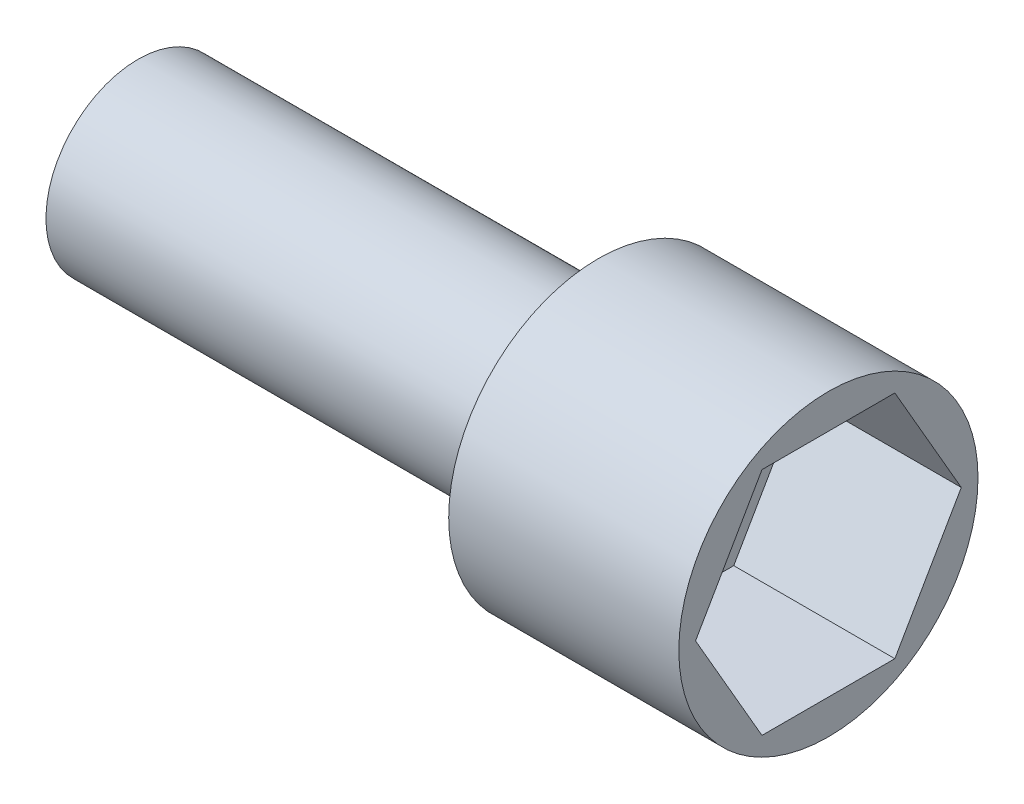
ISO-10303-21;
HEADER;
FILE_DESCRIPTION(('STEP AP214'),'2;1');
FILE_NAME('part.step','',(''),(''),'','','');
FILE_SCHEMA(('AUTOMOTIVE_DESIGN { 1 0 10303 214 1 1 1 1 }'));
ENDSEC;
DATA;
#1=APPLICATION_CONTEXT('core data for automotive mechanical design processes');
#2=APPLICATION_PROTOCOL_DEFINITION('international standard','automotive_design',2000,#1);
#3=PRODUCT_CONTEXT('',#1,'mechanical');
#4=PRODUCT('Part','Part','',(#3));
#5=PRODUCT_RELATED_PRODUCT_CATEGORY('part','',(#4));
#6=PRODUCT_DEFINITION_FORMATION('','',#4);
#7=PRODUCT_DEFINITION_CONTEXT('part definition',#1,'design');
#8=PRODUCT_DEFINITION('design','',#6,#7);
#9=PRODUCT_DEFINITION_SHAPE('','',#8);
#10=(LENGTH_UNIT() NAMED_UNIT(*) SI_UNIT(.MILLI.,.METRE.));
#11=(NAMED_UNIT(*) PLANE_ANGLE_UNIT() SI_UNIT($,.RADIAN.));
#12=(NAMED_UNIT(*) SI_UNIT($,.STERADIAN.) SOLID_ANGLE_UNIT());
#13=UNCERTAINTY_MEASURE_WITH_UNIT(LENGTH_MEASURE(1.E-05),#10,'distance_accuracy_value','');
#14=(GEOMETRIC_REPRESENTATION_CONTEXT(3) GLOBAL_UNCERTAINTY_ASSIGNED_CONTEXT((#13)) GLOBAL_UNIT_ASSIGNED_CONTEXT((#10,
#11,#12)) REPRESENTATION_CONTEXT('',''));
#15=CARTESIAN_POINT('',(0.,0.,0.));
#16=DIRECTION('',(0.,0.,1.));
#17=DIRECTION('',(1.,0.,0.));
#18=AXIS2_PLACEMENT_3D('',#15,#16,#17);
#19=CARTESIAN_POINT('',(15.,6.5,0.));
#20=DIRECTION('',(1.,0.,0.));
#21=DIRECTION('',(0.,1.,0.));
#22=AXIS2_PLACEMENT_3D('',#19,#20,#21);
#23=PLANE('',#22);
#24=DIRECTION('',(0.,0.866025403784439,-0.5));
#25=VECTOR('',#24,1.);
#26=CARTESIAN_POINT('',(15.,-5.,-2.88675134594813));
#27=LINE('',#26,#25);
#28=CARTESIAN_POINT('',(15.,-5.,-2.88675134594813));
#29=VERTEX_POINT('',#28);
#30=CARTESIAN_POINT('',(15.,0.,-5.77350269189626));
#31=VERTEX_POINT('',#30);
#32=EDGE_CURVE('E58',#29,#31,#27,.T.);
#33=ORIENTED_EDGE('',*,*,#32,.F.);
#34=DIRECTION('',(0.,0.,-1.));
#35=VECTOR('',#34,1.);
#36=CARTESIAN_POINT('',(15.,-5.,2.88675134594813));
#37=LINE('',#36,#35);
#38=CARTESIAN_POINT('',(15.,-5.,2.88675134594813));
#39=VERTEX_POINT('',#38);
#40=EDGE_CURVE('E151',#39,#29,#37,.T.);
#41=ORIENTED_EDGE('',*,*,#40,.F.);
#42=DIRECTION('',(0.,-0.866025403784439,-0.5));
#43=VECTOR('',#42,1.);
#44=CARTESIAN_POINT('',(15.,0.,5.77350269189626));
#45=LINE('',#44,#43);
#46=CARTESIAN_POINT('',(15.,0.,5.77350269189626));
#47=VERTEX_POINT('',#46);
#48=EDGE_CURVE('E148',#47,#39,#45,.T.);
#49=ORIENTED_EDGE('',*,*,#48,.F.);
#50=DIRECTION('',(0.,-0.866025403784439,0.5));
#51=VECTOR('',#50,1.);
#52=CARTESIAN_POINT('',(15.,5.,2.88675134594813));
#53=LINE('',#52,#51);
#54=CARTESIAN_POINT('',(15.,5.,2.88675134594813));
#55=VERTEX_POINT('',#54);
#56=EDGE_CURVE('E106',#55,#47,#53,.T.);
#57=ORIENTED_EDGE('',*,*,#56,.F.);
#58=DIRECTION('',(0.,0.,1.));
#59=VECTOR('',#58,1.);
#60=CARTESIAN_POINT('',(15.,5.,-2.88675134594813));
#61=LINE('',#60,#59);
#62=CARTESIAN_POINT('',(15.,5.,-2.88675134594813));
#63=VERTEX_POINT('',#62);
#64=EDGE_CURVE('E142',#63,#55,#61,.T.);
#65=ORIENTED_EDGE('',*,*,#64,.F.);
#66=DIRECTION('',(0.,0.866025403784438,0.5));
#67=VECTOR('',#66,1.);
#68=CARTESIAN_POINT('',(15.,0.,-5.77350269189626));
#69=LINE('',#68,#67);
#70=EDGE_CURVE('E138',#31,#63,#69,.T.);
#71=ORIENTED_EDGE('',*,*,#70,.F.);
#72=EDGE_LOOP('',(#33,#41,#49,#57,#65,#71));
#73=FACE_BOUND('',#72,.T.);
#74=CARTESIAN_POINT('',(15.,0.,0.));
#75=DIRECTION('',(1.,0.,0.));
#76=DIRECTION('',(0.,1.,0.));
#77=AXIS2_PLACEMENT_3D('',#74,#75,#76);
#78=CIRCLE('',#77,6.5);
#79=CARTESIAN_POINT('',(15.,6.5,0.));
#80=VERTEX_POINT('',#79);
#81=EDGE_CURVE('E157',#80,#80,#78,.T.);
#82=ORIENTED_EDGE('',*,*,#81,.T.);
#83=EDGE_LOOP('',(#82));
#84=FACE_BOUND('',#83,.T.);
#85=ADVANCED_FACE('F43',(#73,#84),#23,.T.);
#86=CARTESIAN_POINT('',(-15.,0.,0.));
#87=DIRECTION('',(-1.,0.,0.));
#88=DIRECTION('',(0.,-1.,0.));
#89=AXIS2_PLACEMENT_3D('',#86,#87,#88);
#90=PLANE('',#89);
#91=CARTESIAN_POINT('',(-15.,0.,0.));
#92=DIRECTION('',(1.,0.,0.));
#93=DIRECTION('',(0.,1.,0.));
#94=AXIS2_PLACEMENT_3D('',#91,#92,#93);
#95=CIRCLE('',#94,4.);
#96=CARTESIAN_POINT('',(-15.,4.,0.));
#97=VERTEX_POINT('',#96);
#98=EDGE_CURVE('E11',#97,#97,#95,.T.);
#99=ORIENTED_EDGE('',*,*,#98,.F.);
#100=EDGE_LOOP('',(#99));
#101=FACE_BOUND('',#100,.T.);
#102=ADVANCED_FACE('F182',(#101),#90,.T.);
#103=CARTESIAN_POINT('',(15.,0.,0.));
#104=DIRECTION('',(1.,0.,0.));
#105=DIRECTION('',(0.,1.,0.));
#106=AXIS2_PLACEMENT_3D('',#103,#104,#105);
#107=CYLINDRICAL_SURFACE('',#106,4.);
#108=ORIENTED_EDGE('',*,*,#98,.T.);
#109=EDGE_LOOP('',(#108));
#110=FACE_BOUND('',#109,.T.);
#111=CARTESIAN_POINT('',(5.,0.,0.));
#112=DIRECTION('',(1.,0.,0.));
#113=DIRECTION('',(0.,1.,0.));
#114=AXIS2_PLACEMENT_3D('',#111,#112,#113);
#115=CIRCLE('',#114,4.);
#116=CARTESIAN_POINT('',(5.,4.,0.));
#117=VERTEX_POINT('',#116);
#118=EDGE_CURVE('E51',#117,#117,#115,.T.);
#119=ORIENTED_EDGE('',*,*,#118,.F.);
#120=EDGE_LOOP('',(#119));
#121=FACE_BOUND('',#120,.T.);
#122=ADVANCED_FACE('F180',(#110,#121),#107,.T.);
#123=CARTESIAN_POINT('',(5.,4.,0.));
#124=DIRECTION('',(-1.,0.,0.));
#125=DIRECTION('',(0.,-1.,0.));
#126=AXIS2_PLACEMENT_3D('',#123,#124,#125);
#127=PLANE('',#126);
#128=ORIENTED_EDGE('',*,*,#118,.T.);
#129=EDGE_LOOP('',(#128));
#130=FACE_BOUND('',#129,.T.);
#131=CARTESIAN_POINT('',(5.,0.,0.));
#132=DIRECTION('',(1.,0.,0.));
#133=DIRECTION('',(0.,1.,0.));
#134=AXIS2_PLACEMENT_3D('',#131,#132,#133);
#135=CIRCLE('',#134,6.5);
#136=CARTESIAN_POINT('',(5.,6.5,0.));
#137=VERTEX_POINT('',#136);
#138=EDGE_CURVE('E170',#137,#137,#135,.T.);
#139=ORIENTED_EDGE('',*,*,#138,.F.);
#140=EDGE_LOOP('',(#139));
#141=FACE_BOUND('',#140,.T.);
#142=ADVANCED_FACE('F177',(#130,#141),#127,.T.);
#143=CARTESIAN_POINT('',(15.,0.,0.));
#144=DIRECTION('',(1.,0.,0.));
#145=DIRECTION('',(0.,1.,0.));
#146=AXIS2_PLACEMENT_3D('',#143,#144,#145);
#147=CYLINDRICAL_SURFACE('',#146,6.5);
#148=ORIENTED_EDGE('',*,*,#138,.T.);
#149=EDGE_LOOP('',(#148));
#150=FACE_BOUND('',#149,.T.);
#151=ORIENTED_EDGE('',*,*,#81,.F.);
#152=EDGE_LOOP('',(#151));
#153=FACE_BOUND('',#152,.T.);
#154=ADVANCED_FACE('F189',(#150,#153),#147,.T.);
#155=CARTESIAN_POINT('',(8.,-5.,-2.88675134594813));
#156=DIRECTION('',(0.,-0.5,-0.866025403784439));
#157=DIRECTION('',(0.,0.866025403784439,-0.5));
#158=AXIS2_PLACEMENT_3D('',#155,#156,#157);
#159=PLANE('',#158);
#160=ORIENTED_EDGE('',*,*,#32,.T.);
#161=DIRECTION('',(1.,0.,0.));
#162=VECTOR('',#161,1.);
#163=CARTESIAN_POINT('',(8.,0.,-5.77350269189626));
#164=LINE('',#163,#162);
#165=CARTESIAN_POINT('',(8.,0.,-5.77350269189626));
#166=VERTEX_POINT('',#165);
#167=EDGE_CURVE('E88',#166,#31,#164,.T.);
#168=ORIENTED_EDGE('',*,*,#167,.F.);
#169=DIRECTION('',(0.,0.866025403784439,-0.5));
#170=VECTOR('',#169,1.);
#171=CARTESIAN_POINT('',(8.,-5.,-2.88675134594813));
#172=LINE('',#171,#170);
#173=CARTESIAN_POINT('',(8.,-5.,-2.88675134594813));
#174=VERTEX_POINT('',#173);
#175=EDGE_CURVE('E154',#174,#166,#172,.T.);
#176=ORIENTED_EDGE('',*,*,#175,.F.);
#177=DIRECTION('',(1.,0.,0.));
#178=VECTOR('',#177,1.);
#179=CARTESIAN_POINT('',(8.,-5.,-2.88675134594813));
#180=LINE('',#179,#178);
#181=EDGE_CURVE('E66',#174,#29,#180,.T.);
#182=ORIENTED_EDGE('',*,*,#181,.T.);
#183=EDGE_LOOP('',(#160,#168,#176,#182));
#184=FACE_BOUND('',#183,.T.);
#185=ADVANCED_FACE('F202',(#184),#159,.F.);
#186=CARTESIAN_POINT('',(8.,-5.,2.88675134594813));
#187=DIRECTION('',(0.,-1.,0.));
#188=DIRECTION('',(0.,0.,-1.));
#189=AXIS2_PLACEMENT_3D('',#186,#187,#188);
#190=PLANE('',#189);
#191=ORIENTED_EDGE('',*,*,#40,.T.);
#192=ORIENTED_EDGE('',*,*,#181,.F.);
#193=DIRECTION('',(0.,0.,-1.));
#194=VECTOR('',#193,1.);
#195=CARTESIAN_POINT('',(8.,-5.,2.88675134594813));
#196=LINE('',#195,#194);
#197=CARTESIAN_POINT('',(8.,-5.,2.88675134594813));
#198=VERTEX_POINT('',#197);
#199=EDGE_CURVE('E120',#198,#174,#196,.T.);
#200=ORIENTED_EDGE('',*,*,#199,.F.);
#201=DIRECTION('',(1.,0.,0.));
#202=VECTOR('',#201,1.);
#203=CARTESIAN_POINT('',(8.,-5.,2.88675134594813));
#204=LINE('',#203,#202);
#205=EDGE_CURVE('E111',#198,#39,#204,.T.);
#206=ORIENTED_EDGE('',*,*,#205,.T.);
#207=EDGE_LOOP('',(#191,#192,#200,#206));
#208=FACE_BOUND('',#207,.T.);
#209=ADVANCED_FACE('F208',(#208),#190,.F.);
#210=CARTESIAN_POINT('',(8.,0.,5.77350269189626));
#211=DIRECTION('',(0.,-0.5,0.866025403784439));
#212=DIRECTION('',(0.,-0.866025403784439,-0.5));
#213=AXIS2_PLACEMENT_3D('',#210,#211,#212);
#214=PLANE('',#213);
#215=ORIENTED_EDGE('',*,*,#48,.T.);
#216=ORIENTED_EDGE('',*,*,#205,.F.);
#217=DIRECTION('',(0.,-0.866025403784439,-0.5));
#218=VECTOR('',#217,1.);
#219=CARTESIAN_POINT('',(8.,0.,5.77350269189626));
#220=LINE('',#219,#218);
#221=CARTESIAN_POINT('',(8.,0.,5.77350269189626));
#222=VERTEX_POINT('',#221);
#223=EDGE_CURVE('E115',#222,#198,#220,.T.);
#224=ORIENTED_EDGE('',*,*,#223,.F.);
#225=DIRECTION('',(1.,0.,0.));
#226=VECTOR('',#225,1.);
#227=CARTESIAN_POINT('',(8.,0.,5.77350269189626));
#228=LINE('',#227,#226);
#229=EDGE_CURVE('E99',#222,#47,#228,.T.);
#230=ORIENTED_EDGE('',*,*,#229,.T.);
#231=EDGE_LOOP('',(#215,#216,#224,#230));
#232=FACE_BOUND('',#231,.T.);
#233=ADVANCED_FACE('F116',(#232),#214,.F.);
#234=CARTESIAN_POINT('',(8.,5.,2.88675134594813));
#235=DIRECTION('',(0.,0.5,0.866025403784439));
#236=DIRECTION('',(0.,-0.866025403784439,0.5));
#237=AXIS2_PLACEMENT_3D('',#234,#235,#236);
#238=PLANE('',#237);
#239=ORIENTED_EDGE('',*,*,#56,.T.);
#240=ORIENTED_EDGE('',*,*,#229,.F.);
#241=DIRECTION('',(0.,-0.866025403784439,0.5));
#242=VECTOR('',#241,1.);
#243=CARTESIAN_POINT('',(8.,5.,2.88675134594813));
#244=LINE('',#243,#242);
#245=CARTESIAN_POINT('',(8.,5.,2.88675134594813));
#246=VERTEX_POINT('',#245);
#247=EDGE_CURVE('E103',#246,#222,#244,.T.);
#248=ORIENTED_EDGE('',*,*,#247,.F.);
#249=DIRECTION('',(1.,0.,0.));
#250=VECTOR('',#249,1.);
#251=CARTESIAN_POINT('',(8.,5.,2.88675134594813));
#252=LINE('',#251,#250);
#253=EDGE_CURVE('E112',#246,#55,#252,.T.);
#254=ORIENTED_EDGE('',*,*,#253,.T.);
#255=EDGE_LOOP('',(#239,#240,#248,#254));
#256=FACE_BOUND('',#255,.T.);
#257=ADVANCED_FACE('F101',(#256),#238,.F.);
#258=CARTESIAN_POINT('',(8.,5.,-2.88675134594813));
#259=DIRECTION('',(0.,1.,0.));
#260=DIRECTION('',(-1.,0.,0.));
#261=AXIS2_PLACEMENT_3D('',#258,#259,#260);
#262=PLANE('',#261);
#263=ORIENTED_EDGE('',*,*,#64,.T.);
#264=ORIENTED_EDGE('',*,*,#253,.F.);
#265=DIRECTION('',(0.,0.,1.));
#266=VECTOR('',#265,1.);
#267=CARTESIAN_POINT('',(8.,5.,-2.88675134594813));
#268=LINE('',#267,#266);
#269=CARTESIAN_POINT('',(8.,5.,-2.88675134594813));
#270=VERTEX_POINT('',#269);
#271=EDGE_CURVE('E126',#270,#246,#268,.T.);
#272=ORIENTED_EDGE('',*,*,#271,.F.);
#273=DIRECTION('',(1.,0.,0.));
#274=VECTOR('',#273,1.);
#275=CARTESIAN_POINT('',(8.,5.,-2.88675134594813));
#276=LINE('',#275,#274);
#277=EDGE_CURVE('E162',#270,#63,#276,.T.);
#278=ORIENTED_EDGE('',*,*,#277,.T.);
#279=EDGE_LOOP('',(#263,#264,#272,#278));
#280=FACE_BOUND('',#279,.T.);
#281=ADVANCED_FACE('F214',(#280),#262,.F.);
#282=CARTESIAN_POINT('',(8.,0.,-5.77350269189626));
#283=DIRECTION('',(0.,0.5,-0.866025403784438));
#284=DIRECTION('',(0.,0.866025403784439,0.5));
#285=AXIS2_PLACEMENT_3D('',#282,#283,#284);
#286=PLANE('',#285);
#287=ORIENTED_EDGE('',*,*,#70,.T.);
#288=ORIENTED_EDGE('',*,*,#277,.F.);
#289=DIRECTION('',(0.,0.866025403784438,0.5));
#290=VECTOR('',#289,1.);
#291=CARTESIAN_POINT('',(8.,0.,-5.77350269189626));
#292=LINE('',#291,#290);
#293=EDGE_CURVE('E130',#166,#270,#292,.T.);
#294=ORIENTED_EDGE('',*,*,#293,.F.);
#295=ORIENTED_EDGE('',*,*,#167,.T.);
#296=EDGE_LOOP('',(#287,#288,#294,#295));
#297=FACE_BOUND('',#296,.T.);
#298=ADVANCED_FACE('F211',(#297),#286,.F.);
#299=CARTESIAN_POINT('',(8.,0.,0.));
#300=DIRECTION('',(1.,0.,0.));
#301=DIRECTION('',(0.,0.,-1.));
#302=AXIS2_PLACEMENT_3D('',#299,#300,#301);
#303=PLANE('',#302);
#304=ORIENTED_EDGE('',*,*,#175,.T.);
#305=ORIENTED_EDGE('',*,*,#293,.T.);
#306=ORIENTED_EDGE('',*,*,#271,.T.);
#307=ORIENTED_EDGE('',*,*,#247,.T.);
#308=ORIENTED_EDGE('',*,*,#223,.T.);
#309=ORIENTED_EDGE('',*,*,#199,.T.);
#310=EDGE_LOOP('',(#304,#305,#306,#307,#308,#309));
#311=FACE_BOUND('',#310,.T.);
#312=ADVANCED_FACE('F123',(#311),#303,.T.);
#313=CLOSED_SHELL('',(#85,#102,#122,#142,#154,#185,#209,#233,#257,#281,#298,#312));
#314=MANIFOLD_SOLID_BREP('B2',#313);
#315=ADVANCED_BREP_SHAPE_REPRESENTATION('',(#18,#314),#14);
#316=SHAPE_DEFINITION_REPRESENTATION(#9,#315);
ENDSEC;
END-ISO-10303-21;
